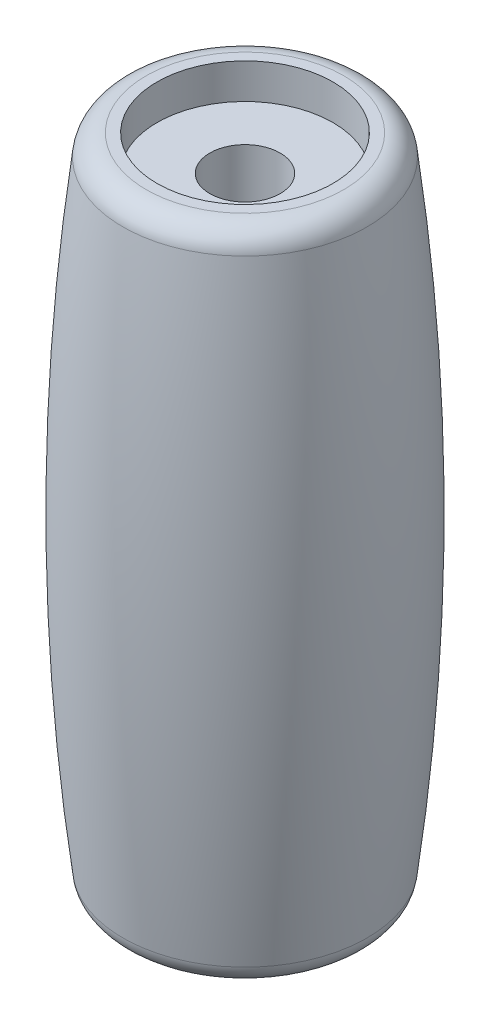
ISO-10303-21;
HEADER;
FILE_DESCRIPTION(('STEP AP214'),'2;1');
FILE_NAME('part.step','',(''),(''),'','','');
FILE_SCHEMA(('AUTOMOTIVE_DESIGN { 1 0 10303 214 1 1 1 1 }'));
ENDSEC;
DATA;
#1=APPLICATION_CONTEXT('core data for automotive mechanical design processes');
#2=APPLICATION_PROTOCOL_DEFINITION('international standard','automotive_design',2000,#1);
#3=PRODUCT_CONTEXT('',#1,'mechanical');
#4=PRODUCT('Part','Part','',(#3));
#5=PRODUCT_RELATED_PRODUCT_CATEGORY('part','',(#4));
#6=PRODUCT_DEFINITION_FORMATION('','',#4);
#7=PRODUCT_DEFINITION_CONTEXT('part definition',#1,'design');
#8=PRODUCT_DEFINITION('design','',#6,#7);
#9=PRODUCT_DEFINITION_SHAPE('','',#8);
#10=(LENGTH_UNIT() NAMED_UNIT(*) SI_UNIT(.MILLI.,.METRE.));
#11=(NAMED_UNIT(*) PLANE_ANGLE_UNIT() SI_UNIT($,.RADIAN.));
#12=(NAMED_UNIT(*) SI_UNIT($,.STERADIAN.) SOLID_ANGLE_UNIT());
#13=UNCERTAINTY_MEASURE_WITH_UNIT(LENGTH_MEASURE(1.E-05),#10,'distance_accuracy_value','');
#14=(GEOMETRIC_REPRESENTATION_CONTEXT(3) GLOBAL_UNCERTAINTY_ASSIGNED_CONTEXT((#13)) GLOBAL_UNIT_ASSIGNED_CONTEXT((#10,
#11,#12)) REPRESENTATION_CONTEXT('',''));
#15=CARTESIAN_POINT('',(0.,0.,0.));
#16=DIRECTION('',(0.,0.,1.));
#17=DIRECTION('',(1.,0.,0.));
#18=AXIS2_PLACEMENT_3D('',#15,#16,#17);
#19=CARTESIAN_POINT('',(0.,28.,0.));
#20=DIRECTION('',(0.,-1.,0.));
#21=DIRECTION('',(0.,0.,-1.));
#22=AXIS2_PLACEMENT_3D('',#19,#20,#21);
#23=PLANE('',#22);
#24=CARTESIAN_POINT('',(0.,28.,0.));
#25=DIRECTION('',(0.,1.,0.));
#26=DIRECTION('',(0.,0.,1.));
#27=AXIS2_PLACEMENT_3D('',#24,#25,#26);
#28=CIRCLE('',#27,3.75);
#29=CARTESIAN_POINT('',(0.,28.,3.75));
#30=VERTEX_POINT('',#29);
#31=EDGE_CURVE('E54',#30,#30,#28,.T.);
#32=ORIENTED_EDGE('',*,*,#31,.F.);
#33=EDGE_LOOP('',(#32));
#34=FACE_BOUND('',#33,.T.);
#35=CARTESIAN_POINT('',(0.,28.,0.));
#36=DIRECTION('',(0.,-1.,0.));
#37=DIRECTION('',(0.,0.,-1.));
#38=AXIS2_PLACEMENT_3D('',#35,#36,#37);
#39=CIRCLE('',#38,4.20925470627339);
#40=CARTESIAN_POINT('',(0.,28.,-4.20925470627339));
#41=VERTEX_POINT('',#40);
#42=EDGE_CURVE('E10',#41,#41,#39,.T.);
#43=ORIENTED_EDGE('',*,*,#42,.F.);
#44=EDGE_LOOP('',(#43));
#45=FACE_BOUND('',#44,.T.);
#46=ADVANCED_FACE('F34',(#34,#45),#23,.F.);
#47=CARTESIAN_POINT('',(0.,27.,0.));
#48=DIRECTION('',(0.,-1.,0.));
#49=DIRECTION('',(0.,0.,-1.));
#50=AXIS2_PLACEMENT_3D('',#47,#48,#49);
#51=TOROIDAL_SURFACE('',#50,4.20925470627339,1.00000000000001);
#52=CARTESIAN_POINT('',(0.,27.1212046804864,0.));
#53=DIRECTION('',(0.,-1.,0.));
#54=DIRECTION('',(0.,0.,-1.));
#55=AXIS2_PLACEMENT_3D('',#52,#53,#54);
#56=CIRCLE('',#55,5.20188224237554);
#57=CARTESIAN_POINT('',(0.,27.1212046804864,-5.20188224237554));
#58=VERTEX_POINT('',#57);
#59=EDGE_CURVE('E41',#58,#58,#56,.T.);
#60=ORIENTED_EDGE('',*,*,#59,.F.);
#61=EDGE_LOOP('',(#60));
#62=FACE_BOUND('',#61,.T.);
#63=ORIENTED_EDGE('',*,*,#42,.T.);
#64=EDGE_LOOP('',(#63));
#65=FACE_BOUND('',#64,.T.);
#66=ADVANCED_FACE('F90',(#62,#65),#51,.T.);
#67=CARTESIAN_POINT('',(0.,13.9999999999999,0.));
#68=DIRECTION('',(0.,-1.,0.));
#69=DIRECTION('',(0.,0.,-1.));
#70=AXIS2_PLACEMENT_3D('',#67,#68,#69);
#71=DEGENERATE_TOROIDAL_SURFACE('',#70,102.256584051323,108.256584051323,.F.);
#72=CARTESIAN_POINT('',(0.,0.87879531951363,0.));
#73=DIRECTION('',(0.,-1.,0.));
#74=DIRECTION('',(0.,0.,-1.));
#75=AXIS2_PLACEMENT_3D('',#72,#73,#74);
#76=CIRCLE('',#75,5.20188224237555);
#77=CARTESIAN_POINT('',(0.,0.87879531951363,-5.20188224237555));
#78=VERTEX_POINT('',#77);
#79=EDGE_CURVE('E45',#78,#78,#76,.T.);
#80=ORIENTED_EDGE('',*,*,#79,.F.);
#81=EDGE_LOOP('',(#80));
#82=FACE_BOUND('',#81,.T.);
#83=ORIENTED_EDGE('',*,*,#59,.T.);
#84=EDGE_LOOP('',(#83));
#85=FACE_BOUND('',#84,.T.);
#86=ADVANCED_FACE('F94',(#82,#85),#71,.F.);
#87=CARTESIAN_POINT('',(0.,1.,0.));
#88=DIRECTION('',(0.,-1.,0.));
#89=DIRECTION('',(0.,0.,-1.));
#90=AXIS2_PLACEMENT_3D('',#87,#88,#89);
#91=TOROIDAL_SURFACE('',#90,4.20925470627341,1.00000000000001);
#92=CARTESIAN_POINT('',(0.,0.,0.));
#93=DIRECTION('',(0.,-1.,0.));
#94=DIRECTION('',(0.,0.,-1.));
#95=AXIS2_PLACEMENT_3D('',#92,#93,#94);
#96=CIRCLE('',#95,4.20925470627341);
#97=CARTESIAN_POINT('',(0.,0.,-4.20925470627341));
#98=VERTEX_POINT('',#97);
#99=EDGE_CURVE('E50',#98,#98,#96,.T.);
#100=ORIENTED_EDGE('',*,*,#99,.F.);
#101=EDGE_LOOP('',(#100));
#102=FACE_BOUND('',#101,.T.);
#103=ORIENTED_EDGE('',*,*,#79,.T.);
#104=EDGE_LOOP('',(#103));
#105=FACE_BOUND('',#104,.T.);
#106=ADVANCED_FACE('F99',(#102,#105),#91,.T.);
#107=CARTESIAN_POINT('',(0.,0.,0.));
#108=DIRECTION('',(0.,1.,0.));
#109=DIRECTION('',(0.,0.,1.));
#110=AXIS2_PLACEMENT_3D('',#107,#108,#109);
#111=PLANE('',#110);
#112=CARTESIAN_POINT('',(0.,0.,0.));
#113=DIRECTION('',(0.,-1.,0.));
#114=DIRECTION('',(0.,0.,-1.));
#115=AXIS2_PLACEMENT_3D('',#112,#113,#114);
#116=CIRCLE('',#115,3.75);
#117=CARTESIAN_POINT('',(0.,0.,-3.75));
#118=VERTEX_POINT('',#117);
#119=EDGE_CURVE('E60',#118,#118,#116,.T.);
#120=ORIENTED_EDGE('',*,*,#119,.F.);
#121=EDGE_LOOP('',(#120));
#122=FACE_BOUND('',#121,.T.);
#123=ORIENTED_EDGE('',*,*,#99,.T.);
#124=EDGE_LOOP('',(#123));
#125=FACE_BOUND('',#124,.T.);
#126=ADVANCED_FACE('F84',(#122,#125),#111,.F.);
#127=CARTESIAN_POINT('',(0.,26.5,0.));
#128=DIRECTION('',(0.,1.,0.));
#129=DIRECTION('',(0.,0.,1.));
#130=AXIS2_PLACEMENT_3D('',#127,#128,#129);
#131=CYLINDRICAL_SURFACE('',#130,3.75);
#132=CARTESIAN_POINT('',(0.,26.5,0.));
#133=DIRECTION('',(0.,1.,0.));
#134=DIRECTION('',(0.,0.,1.));
#135=AXIS2_PLACEMENT_3D('',#132,#133,#134);
#136=CIRCLE('',#135,3.75);
#137=CARTESIAN_POINT('',(0.,26.5,3.75));
#138=VERTEX_POINT('',#137);
#139=EDGE_CURVE('E53',#138,#138,#136,.T.);
#140=ORIENTED_EDGE('',*,*,#139,.F.);
#141=EDGE_LOOP('',(#140));
#142=FACE_BOUND('',#141,.T.);
#143=ORIENTED_EDGE('',*,*,#31,.T.);
#144=EDGE_LOOP('',(#143));
#145=FACE_BOUND('',#144,.T.);
#146=ADVANCED_FACE('F78',(#142,#145),#131,.F.);
#147=CARTESIAN_POINT('',(0.,26.5,0.));
#148=DIRECTION('',(0.,1.,0.));
#149=DIRECTION('',(0.,0.,1.));
#150=AXIS2_PLACEMENT_3D('',#147,#148,#149);
#151=PLANE('',#150);
#152=CARTESIAN_POINT('',(0.,26.5,0.));
#153=DIRECTION('',(0.,1.,0.));
#154=DIRECTION('',(0.,0.,1.));
#155=AXIS2_PLACEMENT_3D('',#152,#153,#154);
#156=CIRCLE('',#155,1.5);
#157=CARTESIAN_POINT('',(0.,26.5,1.5));
#158=VERTEX_POINT('',#157);
#159=EDGE_CURVE('E37',#158,#158,#156,.T.);
#160=ORIENTED_EDGE('',*,*,#159,.F.);
#161=EDGE_LOOP('',(#160));
#162=FACE_BOUND('',#161,.T.);
#163=ORIENTED_EDGE('',*,*,#139,.T.);
#164=EDGE_LOOP('',(#163));
#165=FACE_BOUND('',#164,.T.);
#166=ADVANCED_FACE('F74',(#162,#165),#151,.T.);
#167=CARTESIAN_POINT('',(0.,1.5,0.));
#168=DIRECTION('',(0.,-1.,0.));
#169=DIRECTION('',(0.,0.,-1.));
#170=AXIS2_PLACEMENT_3D('',#167,#168,#169);
#171=CYLINDRICAL_SURFACE('',#170,3.75);
#172=CARTESIAN_POINT('',(0.,1.5,0.));
#173=DIRECTION('',(0.,-1.,0.));
#174=DIRECTION('',(0.,0.,-1.));
#175=AXIS2_PLACEMENT_3D('',#172,#173,#174);
#176=CIRCLE('',#175,3.75);
#177=CARTESIAN_POINT('',(0.,1.5,-3.75));
#178=VERTEX_POINT('',#177);
#179=EDGE_CURVE('E57',#178,#178,#176,.T.);
#180=ORIENTED_EDGE('',*,*,#179,.F.);
#181=EDGE_LOOP('',(#180));
#182=FACE_BOUND('',#181,.T.);
#183=ORIENTED_EDGE('',*,*,#119,.T.);
#184=EDGE_LOOP('',(#183));
#185=FACE_BOUND('',#184,.T.);
#186=ADVANCED_FACE('F77',(#182,#185),#171,.F.);
#187=CARTESIAN_POINT('',(0.,1.5,0.));
#188=DIRECTION('',(0.,-1.,0.));
#189=DIRECTION('',(0.,0.,-1.));
#190=AXIS2_PLACEMENT_3D('',#187,#188,#189);
#191=PLANE('',#190);
#192=CARTESIAN_POINT('',(0.,1.5,0.));
#193=DIRECTION('',(0.,-1.,0.));
#194=DIRECTION('',(0.,0.,-1.));
#195=AXIS2_PLACEMENT_3D('',#192,#193,#194);
#196=CIRCLE('',#195,1.5);
#197=CARTESIAN_POINT('',(0.,1.5,-1.5));
#198=VERTEX_POINT('',#197);
#199=EDGE_CURVE('E65',#198,#198,#196,.T.);
#200=ORIENTED_EDGE('',*,*,#199,.F.);
#201=EDGE_LOOP('',(#200));
#202=FACE_BOUND('',#201,.T.);
#203=ORIENTED_EDGE('',*,*,#179,.T.);
#204=EDGE_LOOP('',(#203));
#205=FACE_BOUND('',#204,.T.);
#206=ADVANCED_FACE('F112',(#202,#205),#191,.T.);
#207=CARTESIAN_POINT('',(0.,28.,0.));
#208=DIRECTION('',(0.,-1.,0.));
#209=DIRECTION('',(0.,0.,-1.));
#210=AXIS2_PLACEMENT_3D('',#207,#208,#209);
#211=CYLINDRICAL_SURFACE('',#210,1.5);
#212=ORIENTED_EDGE('',*,*,#159,.T.);
#213=EDGE_LOOP('',(#212));
#214=FACE_BOUND('',#213,.T.);
#215=ORIENTED_EDGE('',*,*,#199,.T.);
#216=EDGE_LOOP('',(#215));
#217=FACE_BOUND('',#216,.T.);
#218=ADVANCED_FACE('F72',(#214,#217),#211,.F.);
#219=CLOSED_SHELL('',(#46,#66,#86,#106,#126,#146,#166,#186,#206,#218));
#220=MANIFOLD_SOLID_BREP('B2',#219);
#221=ADVANCED_BREP_SHAPE_REPRESENTATION('',(#18,#220),#14);
#222=SHAPE_DEFINITION_REPRESENTATION(#9,#221);
ENDSEC;
END-ISO-10303-21;
